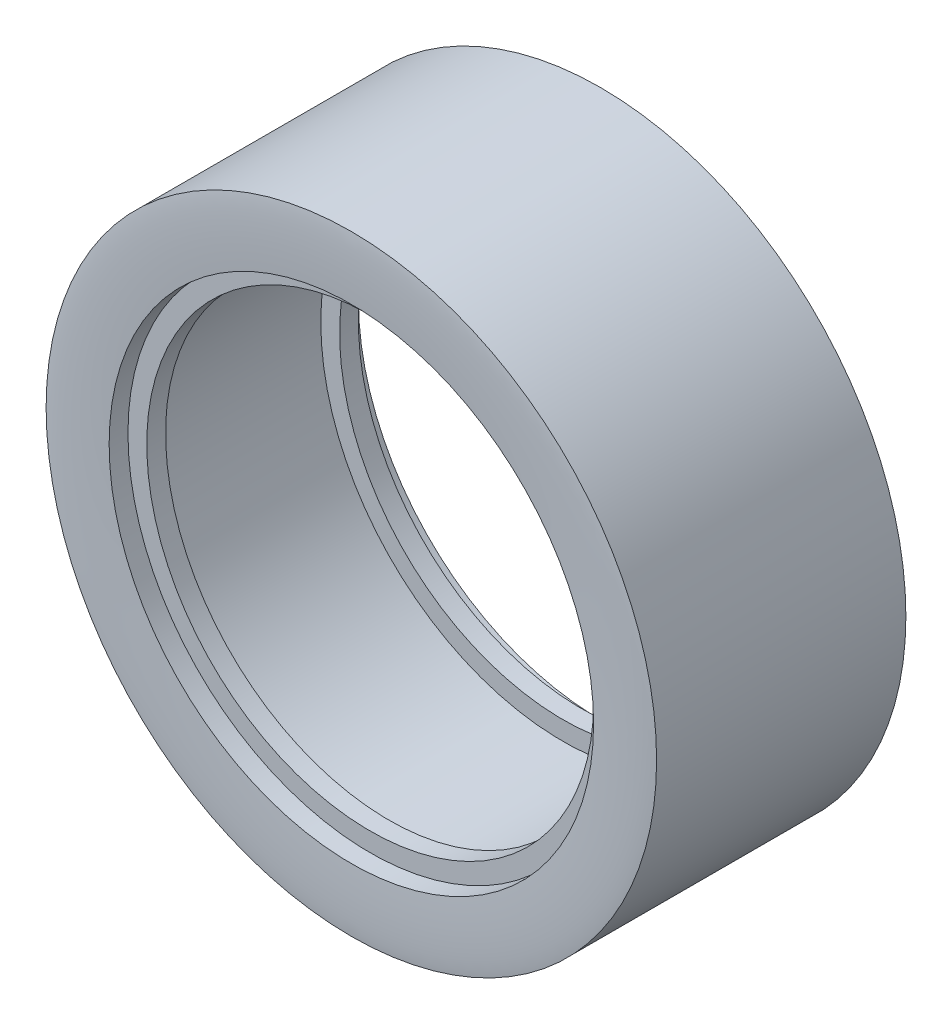
ISO-10303-21;
HEADER;
FILE_DESCRIPTION(('STEP AP214'),'2;1');
FILE_NAME('part.step','',(''),(''),'','','');
FILE_SCHEMA(('AUTOMOTIVE_DESIGN { 1 0 10303 214 1 1 1 1 }'));
ENDSEC;
DATA;
#1=APPLICATION_CONTEXT('core data for automotive mechanical design processes');
#2=APPLICATION_PROTOCOL_DEFINITION('international standard','automotive_design',2000,#1);
#3=PRODUCT_CONTEXT('',#1,'mechanical');
#4=PRODUCT('Part','Part','',(#3));
#5=PRODUCT_RELATED_PRODUCT_CATEGORY('part','',(#4));
#6=PRODUCT_DEFINITION_FORMATION('','',#4);
#7=PRODUCT_DEFINITION_CONTEXT('part definition',#1,'design');
#8=PRODUCT_DEFINITION('design','',#6,#7);
#9=PRODUCT_DEFINITION_SHAPE('','',#8);
#10=(LENGTH_UNIT() NAMED_UNIT(*) SI_UNIT(.MILLI.,.METRE.));
#11=(NAMED_UNIT(*) PLANE_ANGLE_UNIT() SI_UNIT($,.RADIAN.));
#12=(NAMED_UNIT(*) SI_UNIT($,.STERADIAN.) SOLID_ANGLE_UNIT());
#13=UNCERTAINTY_MEASURE_WITH_UNIT(LENGTH_MEASURE(1.E-05),#10,'distance_accuracy_value','');
#14=(GEOMETRIC_REPRESENTATION_CONTEXT(3) GLOBAL_UNCERTAINTY_ASSIGNED_CONTEXT((#13)) GLOBAL_UNIT_ASSIGNED_CONTEXT((#10,
#11,#12)) REPRESENTATION_CONTEXT('',''));
#15=CARTESIAN_POINT('',(0.,0.,0.));
#16=DIRECTION('',(0.,0.,1.));
#17=DIRECTION('',(1.,0.,0.));
#18=AXIS2_PLACEMENT_3D('',#15,#16,#17);
#19=CARTESIAN_POINT('',(32.45,0.,-226.600121105112));
#20=CARTESIAN_POINT('',(31.1064954020677,0.,-226.77286410289));
#21=CARTESIAN_POINT('',(28.6652368280812,0.,-226.77286410289));
#22=CARTESIAN_POINT('',(25.75,0.,-226.600121105112));
#23=B_SPLINE_CURVE_WITH_KNOTS('',3,(#19,#20,#21,#22),.UNSPECIFIED.,.F.,.F.,(4,4),(0.,1.),.UNSPECIFIED.);
#24=CARTESIAN_POINT('',(0.,0.,0.));
#25=DIRECTION('',(0.,0.,1.));
#26=AXIS1_PLACEMENT('',#24,#25);
#27=SURFACE_OF_REVOLUTION('',#23,#26);
#28=CARTESIAN_POINT('',(0.,0.,-226.600121105112));
#29=DIRECTION('',(0.,0.,1.));
#30=DIRECTION('',(1.,0.,0.));
#31=AXIS2_PLACEMENT_3D('',#28,#29,#30);
#32=CIRCLE('',#31,25.75);
#33=CARTESIAN_POINT('',(25.75,0.,-226.600121105112));
#34=VERTEX_POINT('',#33);
#35=EDGE_CURVE('E10',#34,#34,#32,.T.);
#36=ORIENTED_EDGE('',*,*,#35,.T.);
#37=EDGE_LOOP('',(#36));
#38=FACE_BOUND('',#37,.T.);
#39=CARTESIAN_POINT('',(0.,0.,-226.600121105112));
#40=DIRECTION('',(0.,0.,1.));
#41=DIRECTION('',(1.,0.,0.));
#42=AXIS2_PLACEMENT_3D('',#39,#40,#41);
#43=CIRCLE('',#42,32.45);
#44=CARTESIAN_POINT('',(32.45,0.,-226.600121105112));
#45=VERTEX_POINT('',#44);
#46=EDGE_CURVE('E76',#45,#45,#43,.T.);
#47=ORIENTED_EDGE('',*,*,#46,.F.);
#48=EDGE_LOOP('',(#47));
#49=FACE_BOUND('',#48,.T.);
#50=ADVANCED_FACE('F35',(#38,#49),#27,.F.);
#51=CARTESIAN_POINT('',(0.,0.,0.));
#52=DIRECTION('',(0.,0.,1.));
#53=DIRECTION('',(1.,0.,0.));
#54=AXIS2_PLACEMENT_3D('',#51,#52,#53);
#55=CYLINDRICAL_SURFACE('',#54,25.75);
#56=CARTESIAN_POINT('',(0.,0.,-224.600121105112));
#57=DIRECTION('',(0.,0.,1.));
#58=DIRECTION('',(1.,0.,0.));
#59=AXIS2_PLACEMENT_3D('',#56,#57,#58);
#60=CIRCLE('',#59,25.75);
#61=CARTESIAN_POINT('',(25.75,0.,-224.600121105112));
#62=VERTEX_POINT('',#61);
#63=EDGE_CURVE('E42',#62,#62,#60,.T.);
#64=ORIENTED_EDGE('',*,*,#63,.T.);
#65=EDGE_LOOP('',(#64));
#66=FACE_BOUND('',#65,.T.);
#67=ORIENTED_EDGE('',*,*,#35,.F.);
#68=EDGE_LOOP('',(#67));
#69=FACE_BOUND('',#68,.T.);
#70=ADVANCED_FACE('F125',(#66,#69),#55,.F.);
#71=CARTESIAN_POINT('',(25.75,0.,-224.600121105112));
#72=DIRECTION('',(0.,0.,-1.));
#73=DIRECTION('',(-1.,0.,0.));
#74=AXIS2_PLACEMENT_3D('',#71,#72,#73);
#75=PLANE('',#74);
#76=CARTESIAN_POINT('',(0.,0.,-224.600121105112));
#77=DIRECTION('',(0.,0.,1.));
#78=DIRECTION('',(1.,0.,0.));
#79=AXIS2_PLACEMENT_3D('',#76,#77,#78);
#80=CIRCLE('',#79,23.75);
#81=CARTESIAN_POINT('',(23.75,0.,-224.600121105112));
#82=VERTEX_POINT('',#81);
#83=EDGE_CURVE('E46',#82,#82,#80,.T.);
#84=ORIENTED_EDGE('',*,*,#83,.T.);
#85=EDGE_LOOP('',(#84));
#86=FACE_BOUND('',#85,.T.);
#87=ORIENTED_EDGE('',*,*,#63,.F.);
#88=EDGE_LOOP('',(#87));
#89=FACE_BOUND('',#88,.T.);
#90=ADVANCED_FACE('F122',(#86,#89),#75,.T.);
#91=CARTESIAN_POINT('',(0.,0.,0.));
#92=DIRECTION('',(0.,0.,1.));
#93=DIRECTION('',(1.,0.,0.));
#94=AXIS2_PLACEMENT_3D('',#91,#92,#93);
#95=CYLINDRICAL_SURFACE('',#94,23.75);
#96=CARTESIAN_POINT('',(0.,0.,-222.600121105112));
#97=DIRECTION('',(0.,0.,1.));
#98=DIRECTION('',(1.,0.,0.));
#99=AXIS2_PLACEMENT_3D('',#96,#97,#98);
#100=CIRCLE('',#99,23.75);
#101=CARTESIAN_POINT('',(23.75,0.,-222.600121105112));
#102=VERTEX_POINT('',#101);
#103=EDGE_CURVE('E50',#102,#102,#100,.T.);
#104=ORIENTED_EDGE('',*,*,#103,.T.);
#105=EDGE_LOOP('',(#104));
#106=FACE_BOUND('',#105,.T.);
#107=ORIENTED_EDGE('',*,*,#83,.F.);
#108=EDGE_LOOP('',(#107));
#109=FACE_BOUND('',#108,.T.);
#110=ADVANCED_FACE('F118',(#106,#109),#95,.F.);
#111=CARTESIAN_POINT('',(25.75,0.,-222.600121105112));
#112=DIRECTION('',(0.,0.,1.));
#113=DIRECTION('',(1.,0.,0.));
#114=AXIS2_PLACEMENT_3D('',#111,#112,#113);
#115=PLANE('',#114);
#116=CARTESIAN_POINT('',(0.,0.,-222.600121105112));
#117=DIRECTION('',(0.,0.,1.));
#118=DIRECTION('',(1.,0.,0.));
#119=AXIS2_PLACEMENT_3D('',#116,#117,#118);
#120=CIRCLE('',#119,25.75);
#121=CARTESIAN_POINT('',(25.75,0.,-222.600121105112));
#122=VERTEX_POINT('',#121);
#123=EDGE_CURVE('E55',#122,#122,#120,.T.);
#124=ORIENTED_EDGE('',*,*,#123,.T.);
#125=EDGE_LOOP('',(#124));
#126=FACE_BOUND('',#125,.T.);
#127=ORIENTED_EDGE('',*,*,#103,.F.);
#128=EDGE_LOOP('',(#127));
#129=FACE_BOUND('',#128,.T.);
#130=ADVANCED_FACE('F114',(#126,#129),#115,.T.);
#131=CARTESIAN_POINT('',(0.,0.,0.));
#132=DIRECTION('',(0.,0.,1.));
#133=DIRECTION('',(1.,0.,0.));
#134=AXIS2_PLACEMENT_3D('',#131,#132,#133);
#135=CYLINDRICAL_SURFACE('',#134,25.75);
#136=CARTESIAN_POINT('',(0.,0.,-204.100121105112));
#137=DIRECTION('',(0.,0.,1.));
#138=DIRECTION('',(1.,0.,0.));
#139=AXIS2_PLACEMENT_3D('',#136,#137,#138);
#140=CIRCLE('',#139,25.75);
#141=CARTESIAN_POINT('',(25.75,0.,-204.100121105112));
#142=VERTEX_POINT('',#141);
#143=EDGE_CURVE('E58',#142,#142,#140,.T.);
#144=ORIENTED_EDGE('',*,*,#143,.T.);
#145=EDGE_LOOP('',(#144));
#146=FACE_BOUND('',#145,.T.);
#147=ORIENTED_EDGE('',*,*,#123,.F.);
#148=EDGE_LOOP('',(#147));
#149=FACE_BOUND('',#148,.T.);
#150=ADVANCED_FACE('F110',(#146,#149),#135,.F.);
#151=CARTESIAN_POINT('',(25.75,0.,-204.100121105112));
#152=DIRECTION('',(0.,0.,-1.));
#153=DIRECTION('',(-1.,0.,0.));
#154=AXIS2_PLACEMENT_3D('',#151,#152,#153);
#155=PLANE('',#154);
#156=CARTESIAN_POINT('',(0.,0.,-204.100121105112));
#157=DIRECTION('',(0.,0.,1.));
#158=DIRECTION('',(1.,0.,0.));
#159=AXIS2_PLACEMENT_3D('',#156,#157,#158);
#160=CIRCLE('',#159,23.75);
#161=CARTESIAN_POINT('',(23.75,0.,-204.100121105112));
#162=VERTEX_POINT('',#161);
#163=EDGE_CURVE('E61',#162,#162,#160,.T.);
#164=ORIENTED_EDGE('',*,*,#163,.T.);
#165=EDGE_LOOP('',(#164));
#166=FACE_BOUND('',#165,.T.);
#167=ORIENTED_EDGE('',*,*,#143,.F.);
#168=EDGE_LOOP('',(#167));
#169=FACE_BOUND('',#168,.T.);
#170=ADVANCED_FACE('F106',(#166,#169),#155,.T.);
#171=CARTESIAN_POINT('',(0.,0.,0.));
#172=DIRECTION('',(0.,0.,1.));
#173=DIRECTION('',(1.,0.,0.));
#174=AXIS2_PLACEMENT_3D('',#171,#172,#173);
#175=CYLINDRICAL_SURFACE('',#174,23.75);
#176=CARTESIAN_POINT('',(0.,0.,-202.100121105112));
#177=DIRECTION('',(0.,0.,1.));
#178=DIRECTION('',(1.,0.,0.));
#179=AXIS2_PLACEMENT_3D('',#176,#177,#178);
#180=CIRCLE('',#179,23.75);
#181=CARTESIAN_POINT('',(23.75,0.,-202.100121105112));
#182=VERTEX_POINT('',#181);
#183=EDGE_CURVE('E64',#182,#182,#180,.T.);
#184=ORIENTED_EDGE('',*,*,#183,.T.);
#185=EDGE_LOOP('',(#184));
#186=FACE_BOUND('',#185,.T.);
#187=ORIENTED_EDGE('',*,*,#163,.F.);
#188=EDGE_LOOP('',(#187));
#189=FACE_BOUND('',#188,.T.);
#190=ADVANCED_FACE('F102',(#186,#189),#175,.F.);
#191=CARTESIAN_POINT('',(25.75,0.,-202.100121105112));
#192=DIRECTION('',(0.,0.,1.));
#193=DIRECTION('',(1.,0.,0.));
#194=AXIS2_PLACEMENT_3D('',#191,#192,#193);
#195=PLANE('',#194);
#196=CARTESIAN_POINT('',(0.,0.,-202.100121105112));
#197=DIRECTION('',(0.,0.,1.));
#198=DIRECTION('',(1.,0.,0.));
#199=AXIS2_PLACEMENT_3D('',#196,#197,#198);
#200=CIRCLE('',#199,25.75);
#201=CARTESIAN_POINT('',(25.75,0.,-202.100121105112));
#202=VERTEX_POINT('',#201);
#203=EDGE_CURVE('E67',#202,#202,#200,.T.);
#204=ORIENTED_EDGE('',*,*,#203,.T.);
#205=EDGE_LOOP('',(#204));
#206=FACE_BOUND('',#205,.T.);
#207=ORIENTED_EDGE('',*,*,#183,.F.);
#208=EDGE_LOOP('',(#207));
#209=FACE_BOUND('',#208,.T.);
#210=ADVANCED_FACE('F98',(#206,#209),#195,.T.);
#211=CARTESIAN_POINT('',(0.,0.,0.));
#212=DIRECTION('',(0.,0.,1.));
#213=DIRECTION('',(1.,0.,0.));
#214=AXIS2_PLACEMENT_3D('',#211,#212,#213);
#215=CYLINDRICAL_SURFACE('',#214,25.75);
#216=CARTESIAN_POINT('',(0.,0.,-200.100121105112));
#217=DIRECTION('',(0.,0.,1.));
#218=DIRECTION('',(1.,0.,0.));
#219=AXIS2_PLACEMENT_3D('',#216,#217,#218);
#220=CIRCLE('',#219,25.75);
#221=CARTESIAN_POINT('',(25.75,0.,-200.100121105112));
#222=VERTEX_POINT('',#221);
#223=EDGE_CURVE('E70',#222,#222,#220,.T.);
#224=ORIENTED_EDGE('',*,*,#223,.T.);
#225=EDGE_LOOP('',(#224));
#226=FACE_BOUND('',#225,.T.);
#227=ORIENTED_EDGE('',*,*,#203,.F.);
#228=EDGE_LOOP('',(#227));
#229=FACE_BOUND('',#228,.T.);
#230=ADVANCED_FACE('F94',(#226,#229),#215,.F.);
#231=CARTESIAN_POINT('',(25.75,0.,-200.100121105112));
#232=CARTESIAN_POINT('',(28.6652368280812,0.,-199.927378107334));
#233=CARTESIAN_POINT('',(31.1064954020677,0.,-199.927378107334));
#234=CARTESIAN_POINT('',(32.45,0.,-200.100121105112));
#235=B_SPLINE_CURVE_WITH_KNOTS('',3,(#231,#232,#233,#234),.UNSPECIFIED.,.F.,.F.,(4,4),(0.,1.),.UNSPECIFIED.);
#236=CARTESIAN_POINT('',(0.,0.,0.));
#237=DIRECTION('',(0.,0.,1.));
#238=AXIS1_PLACEMENT('',#236,#237);
#239=SURFACE_OF_REVOLUTION('',#235,#238);
#240=CARTESIAN_POINT('',(0.,0.,-200.100121105112));
#241=DIRECTION('',(0.,0.,1.));
#242=DIRECTION('',(1.,0.,0.));
#243=AXIS2_PLACEMENT_3D('',#240,#241,#242);
#244=CIRCLE('',#243,32.45);
#245=CARTESIAN_POINT('',(32.45,0.,-200.100121105112));
#246=VERTEX_POINT('',#245);
#247=EDGE_CURVE('E73',#246,#246,#244,.T.);
#248=ORIENTED_EDGE('',*,*,#247,.T.);
#249=EDGE_LOOP('',(#248));
#250=FACE_BOUND('',#249,.T.);
#251=ORIENTED_EDGE('',*,*,#223,.F.);
#252=EDGE_LOOP('',(#251));
#253=FACE_BOUND('',#252,.T.);
#254=ADVANCED_FACE('F89',(#250,#253),#239,.F.);
#255=CARTESIAN_POINT('',(0.,0.,0.));
#256=DIRECTION('',(0.,0.,1.));
#257=DIRECTION('',(1.,0.,0.));
#258=AXIS2_PLACEMENT_3D('',#255,#256,#257);
#259=CYLINDRICAL_SURFACE('',#258,32.45);
#260=ORIENTED_EDGE('',*,*,#46,.T.);
#261=EDGE_LOOP('',(#260));
#262=FACE_BOUND('',#261,.T.);
#263=ORIENTED_EDGE('',*,*,#247,.F.);
#264=EDGE_LOOP('',(#263));
#265=FACE_BOUND('',#264,.T.);
#266=ADVANCED_FACE('F93',(#262,#265),#259,.T.);
#267=CLOSED_SHELL('',(#50,#70,#90,#110,#130,#150,#170,#190,#210,#230,#254,#266));
#268=MANIFOLD_SOLID_BREP('B2',#267);
#269=ADVANCED_BREP_SHAPE_REPRESENTATION('',(#18,#268),#14);
#270=SHAPE_DEFINITION_REPRESENTATION(#9,#269);
ENDSEC;
END-ISO-10303-21;
